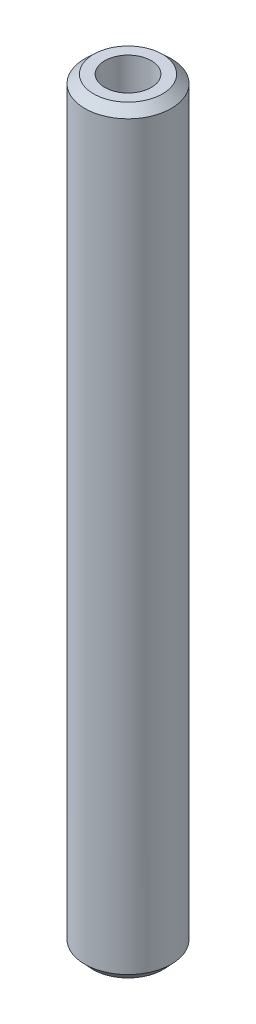
ISO-10303-21;
HEADER;
FILE_DESCRIPTION(('STEP AP214'),'2;1');
FILE_NAME('part.step','',(''),(''),'','','');
FILE_SCHEMA(('AUTOMOTIVE_DESIGN { 1 0 10303 214 1 1 1 1 }'));
ENDSEC;
DATA;
#1=APPLICATION_CONTEXT('core data for automotive mechanical design processes');
#2=APPLICATION_PROTOCOL_DEFINITION('international standard','automotive_design',2000,#1);
#3=PRODUCT_CONTEXT('',#1,'mechanical');
#4=PRODUCT('Part','Part','',(#3));
#5=PRODUCT_RELATED_PRODUCT_CATEGORY('part','',(#4));
#6=PRODUCT_DEFINITION_FORMATION('','',#4);
#7=PRODUCT_DEFINITION_CONTEXT('part definition',#1,'design');
#8=PRODUCT_DEFINITION('design','',#6,#7);
#9=PRODUCT_DEFINITION_SHAPE('','',#8);
#10=(LENGTH_UNIT() NAMED_UNIT(*) SI_UNIT(.MILLI.,.METRE.));
#11=(NAMED_UNIT(*) PLANE_ANGLE_UNIT() SI_UNIT($,.RADIAN.));
#12=(NAMED_UNIT(*) SI_UNIT($,.STERADIAN.) SOLID_ANGLE_UNIT());
#13=UNCERTAINTY_MEASURE_WITH_UNIT(LENGTH_MEASURE(1.E-05),#10,'distance_accuracy_value','');
#14=(GEOMETRIC_REPRESENTATION_CONTEXT(3) GLOBAL_UNCERTAINTY_ASSIGNED_CONTEXT((#13)) GLOBAL_UNIT_ASSIGNED_CONTEXT((#10,
#11,#12)) REPRESENTATION_CONTEXT('',''));
#15=CARTESIAN_POINT('',(0.,0.,0.));
#16=DIRECTION('',(0.,0.,1.));
#17=DIRECTION('',(1.,0.,0.));
#18=AXIS2_PLACEMENT_3D('',#15,#16,#17);
#19=CARTESIAN_POINT('',(0.,351.146910128849,0.));
#20=DIRECTION('',(0.,-1.,0.));
#21=DIRECTION('',(0.,0.,-1.));
#22=AXIS2_PLACEMENT_3D('',#19,#20,#21);
#23=CYLINDRICAL_SURFACE('',#22,20.);
#24=CARTESIAN_POINT('',(0.,347.326021928846,0.));
#25=DIRECTION('',(0.,1.,0.));
#26=DIRECTION('',(0.,0.,1.));
#27=AXIS2_PLACEMENT_3D('',#24,#25,#26);
#28=CIRCLE('',#27,20.);
#29=CARTESIAN_POINT('',(0.,347.326021928846,-20.));
#30=VERTEX_POINT('',#29);
#31=EDGE_CURVE('E50',#30,#30,#28,.F.);
#32=ORIENTED_EDGE('',*,*,#31,.T.);
#33=EDGE_LOOP('',(#32));
#34=FACE_BOUND('',#33,.T.);
#35=CARTESIAN_POINT('',(0.,4.06765184412189,0.));
#36=DIRECTION('',(0.,1.,0.));
#37=DIRECTION('',(0.,0.,1.));
#38=AXIS2_PLACEMENT_3D('',#35,#36,#37);
#39=CIRCLE('',#38,20.);
#40=CARTESIAN_POINT('',(0.,4.06765184412189,20.));
#41=VERTEX_POINT('',#40);
#42=EDGE_CURVE('E51',#41,#41,#39,.T.);
#43=ORIENTED_EDGE('',*,*,#42,.T.);
#44=EDGE_LOOP('',(#43));
#45=FACE_BOUND('',#44,.T.);
#46=ADVANCED_FACE('F39',(#34,#45),#23,.T.);
#47=CARTESIAN_POINT('',(0.,351.146910128849,0.));
#48=DIRECTION('',(0.,1.,0.));
#49=DIRECTION('',(0.,0.,1.));
#50=AXIS2_PLACEMENT_3D('',#47,#48,#49);
#51=PLANE('',#50);
#52=CARTESIAN_POINT('',(0.,351.146910128849,0.));
#53=DIRECTION('',(0.,1.,0.));
#54=DIRECTION('',(0.,0.,1.));
#55=AXIS2_PLACEMENT_3D('',#52,#53,#54);
#56=CIRCLE('',#55,15.932348155878);
#57=CARTESIAN_POINT('',(0.,351.146910128849,-15.932348155878));
#58=VERTEX_POINT('',#57);
#59=EDGE_CURVE('E54',#58,#58,#56,.T.);
#60=ORIENTED_EDGE('',*,*,#59,.T.);
#61=EDGE_LOOP('',(#60));
#62=FACE_BOUND('',#61,.T.);
#63=CARTESIAN_POINT('',(0.,351.146910128849,0.));
#64=DIRECTION('',(0.,1.,0.));
#65=DIRECTION('',(0.,0.,1.));
#66=AXIS2_PLACEMENT_3D('',#63,#64,#65);
#67=CIRCLE('',#66,10.7670784835726);
#68=CARTESIAN_POINT('',(0.,351.146910128849,10.7670784835726));
#69=VERTEX_POINT('',#68);
#70=EDGE_CURVE('E58',#69,#69,#67,.T.);
#71=ORIENTED_EDGE('',*,*,#70,.F.);
#72=EDGE_LOOP('',(#71));
#73=FACE_BOUND('',#72,.T.);
#74=ADVANCED_FACE('F69',(#62,#73),#51,.T.);
#75=CARTESIAN_POINT('',(0.,0.,0.));
#76=DIRECTION('',(0.,1.,0.));
#77=DIRECTION('',(0.,0.,1.));
#78=AXIS2_PLACEMENT_3D('',#75,#76,#77);
#79=PLANE('',#78);
#80=CARTESIAN_POINT('',(0.,0.,0.));
#81=DIRECTION('',(0.,1.,0.));
#82=DIRECTION('',(0.,0.,1.));
#83=AXIS2_PLACEMENT_3D('',#80,#81,#82);
#84=CIRCLE('',#83,16.1791117999965);
#85=CARTESIAN_POINT('',(0.,0.,16.1791117999965));
#86=VERTEX_POINT('',#85);
#87=EDGE_CURVE('E10',#86,#86,#84,.F.);
#88=ORIENTED_EDGE('',*,*,#87,.T.);
#89=EDGE_LOOP('',(#88));
#90=FACE_BOUND('',#89,.T.);
#91=CARTESIAN_POINT('',(0.,0.,0.));
#92=DIRECTION('',(0.,1.,0.));
#93=DIRECTION('',(0.,0.,1.));
#94=AXIS2_PLACEMENT_3D('',#91,#92,#93);
#95=CIRCLE('',#94,10.7670784835726);
#96=CARTESIAN_POINT('',(0.,0.,10.7670784835726));
#97=VERTEX_POINT('',#96);
#98=EDGE_CURVE('E63',#97,#97,#95,.T.);
#99=ORIENTED_EDGE('',*,*,#98,.T.);
#100=EDGE_LOOP('',(#99));
#101=FACE_BOUND('',#100,.T.);
#102=ADVANCED_FACE('F75',(#90,#101),#79,.F.);
#103=CARTESIAN_POINT('',(0.,351.146910128849,0.));
#104=DIRECTION('',(0.,-1.,0.));
#105=DIRECTION('',(0.,0.,-1.));
#106=AXIS2_PLACEMENT_3D('',#103,#104,#105);
#107=CYLINDRICAL_SURFACE('',#106,10.7670784835726);
#108=ORIENTED_EDGE('',*,*,#70,.T.);
#109=EDGE_LOOP('',(#108));
#110=FACE_BOUND('',#109,.T.);
#111=ORIENTED_EDGE('',*,*,#98,.F.);
#112=EDGE_LOOP('',(#111));
#113=FACE_BOUND('',#112,.T.);
#114=ADVANCED_FACE('F70',(#110,#113),#107,.F.);
#115=CARTESIAN_POINT('',(0.,351.146910128849,0.));
#116=DIRECTION('',(0.,-1.,0.));
#117=DIRECTION('',(0.,0.,-1.));
#118=AXIS2_PLACEMENT_3D('',#115,#116,#117);
#119=CONICAL_SURFACE('',#118,15.932348155878,0.816669248079316);
#120=CARTESIAN_POINT('',(0.,347.326021928846,-20.));
#121=CARTESIAN_POINT('',(0.,347.365822847596,-19.9576286266238));
#122=CARTESIAN_POINT('',(0.,347.405623766346,-19.9152572532475));
#123=CARTESIAN_POINT('',(0.,347.485225603846,-19.8305145064949));
#124=CARTESIAN_POINT('',(0.,347.525026522596,-19.7881431331187));
#125=CARTESIAN_POINT('',(0.,347.604628360096,-19.7034003863661));
#126=CARTESIAN_POINT('',(0.,347.644429278846,-19.6610290129899));
#127=CARTESIAN_POINT('',(0.,347.724031116346,-19.5762862662373));
#128=CARTESIAN_POINT('',(0.,347.763832035096,-19.5339148928611));
#129=CARTESIAN_POINT('',(0.,347.843433872596,-19.4491721461085));
#130=CARTESIAN_POINT('',(0.,347.883234791346,-19.4068007727322));
#131=CARTESIAN_POINT('',(0.,347.962836628846,-19.3220580259797));
#132=CARTESIAN_POINT('',(0.,348.002637547596,-19.2796866526034));
#133=CARTESIAN_POINT('',(0.,348.082239385096,-19.1949439058509));
#134=CARTESIAN_POINT('',(0.,348.122040303846,-19.1525725324746));
#135=CARTESIAN_POINT('',(0.,348.201642141346,-19.0678297857221));
#136=CARTESIAN_POINT('',(0.,348.241443060096,-19.0254584123458));
#137=CARTESIAN_POINT('',(0.,348.321044897596,-18.9407156655933));
#138=CARTESIAN_POINT('',(0.,348.360845816347,-18.898344292217));
#139=CARTESIAN_POINT('',(0.,348.440447653847,-18.8136015454645));
#140=CARTESIAN_POINT('',(0.,348.480248572597,-18.7712301720882));
#141=CARTESIAN_POINT('',(0.,348.559850410097,-18.6864874253356));
#142=CARTESIAN_POINT('',(0.,348.599651328847,-18.6441160519594));
#143=CARTESIAN_POINT('',(0.,348.679253166347,-18.5593733052068));
#144=CARTESIAN_POINT('',(0.,348.719054085097,-18.5170019318306));
#145=CARTESIAN_POINT('',(0.,348.798655922597,-18.432259185078));
#146=CARTESIAN_POINT('',(0.,348.838456841347,-18.3898878117017));
#147=CARTESIAN_POINT('',(0.,348.918058678847,-18.3051450649492));
#148=CARTESIAN_POINT('',(0.,348.957859597597,-18.2627736915729));
#149=CARTESIAN_POINT('',(0.,349.037461435097,-18.1780309448204));
#150=CARTESIAN_POINT('',(0.,349.077262353847,-18.1356595714441));
#151=CARTESIAN_POINT('',(0.,349.156864191347,-18.0509168246916));
#152=CARTESIAN_POINT('',(0.,349.196665110097,-18.0085454513153));
#153=CARTESIAN_POINT('',(0.,349.276266947597,-17.9238027045628));
#154=CARTESIAN_POINT('',(0.,349.316067866347,-17.8814313311865));
#155=CARTESIAN_POINT('',(0.,349.395669703847,-17.796688584434));
#156=CARTESIAN_POINT('',(0.,349.435470622598,-17.7543172110577));
#157=CARTESIAN_POINT('',(0.,349.515072460098,-17.6695744643051));
#158=CARTESIAN_POINT('',(0.,349.554873378848,-17.6272030909289));
#159=CARTESIAN_POINT('',(0.,349.634475216348,-17.5424603441763));
#160=CARTESIAN_POINT('',(0.,349.674276135098,-17.5000889708001));
#161=CARTESIAN_POINT('',(0.,349.753877972598,-17.4153462240475));
#162=CARTESIAN_POINT('',(0.,349.793678891348,-17.3729748506712));
#163=CARTESIAN_POINT('',(0.,349.873280728848,-17.2882321039187));
#164=CARTESIAN_POINT('',(0.,349.913081647598,-17.2458607305424));
#165=CARTESIAN_POINT('',(0.,349.992683485098,-17.1611179837899));
#166=CARTESIAN_POINT('',(0.,350.032484403848,-17.1187466104136));
#167=CARTESIAN_POINT('',(0.,350.112086241348,-17.0340038636611));
#168=CARTESIAN_POINT('',(0.,350.151887160098,-16.9916324902848));
#169=CARTESIAN_POINT('',(0.,350.231488997598,-16.9068897435323));
#170=CARTESIAN_POINT('',(0.,350.271289916348,-16.864518370156));
#171=CARTESIAN_POINT('',(0.,350.350891753848,-16.7797756234035));
#172=CARTESIAN_POINT('',(0.,350.390692672598,-16.7374042500272));
#173=CARTESIAN_POINT('',(0.,350.470294510098,-16.6526615032747));
#174=CARTESIAN_POINT('',(0.,350.510095428849,-16.6102901298984));
#175=CARTESIAN_POINT('',(0.,350.589697266349,-16.5255473831458));
#176=CARTESIAN_POINT('',(0.,350.629498185099,-16.4831760097696));
#177=CARTESIAN_POINT('',(0.,350.709100022599,-16.398433263017));
#178=CARTESIAN_POINT('',(0.,350.748900941349,-16.3560618896408));
#179=CARTESIAN_POINT('',(0.,350.828502778849,-16.2713191428882));
#180=CARTESIAN_POINT('',(0.,350.868303697599,-16.2289477695119));
#181=CARTESIAN_POINT('',(0.,350.947905535099,-16.1442050227594));
#182=CARTESIAN_POINT('',(0.,350.987706453849,-16.1018336493831));
#183=CARTESIAN_POINT('',(0.,351.067308291349,-16.0170909026306));
#184=CARTESIAN_POINT('',(0.,351.107109210099,-15.9747195292543));
#185=CARTESIAN_POINT('',(0.,351.146910128849,-15.932348155878));
#186=B_SPLINE_CURVE_WITH_KNOTS('',3,(#120,#121,#122,#123,#124,#125,#126,#127,#128,#129,#130,
#131,#132,#133,#134,#135,#136,#137,#138,#139,#140,#141,#142,#143,#144,#145,#146,#147,#148,#149,
#150,#151,#152,#153,#154,#155,#156,#157,#158,#159,#160,#161,#162,#163,#164,#165,#166,#167,#168,
#169,#170,#171,#172,#173,#174,#175,#176,#177,#178,#179,#180,#181,#182,#183,#184,#185),
.UNSPECIFIED.,.F.,.F.,(4,2,2,2,2,2,2,2,2,2,2,2,2,2,2,2,2,2,2,2,2,2,2,2,2,2,2,2,2,2,2,2,4),(0.,
0.174399018736475,0.348798037472948,0.523197056209421,0.697596074945897,0.87199509368237,
1.04639411241884,1.22079313115532,1.39519214989179,1.56959116862827,1.74399018736474,
1.91838920610121,2.09278822483769,2.26718724357416,2.44158626231063,2.61598528104711,
2.79038429978358,2.96478331852005,3.13918233725653,3.313581355993,3.48798037472948,
3.66237939346595,3.83677841220242,4.0111774309389,4.18557644967537,4.35997546841184,
4.53437448714832,4.70877350588479,4.88317252462127,5.05757154335774,5.23197056209422,
5.40636958083069,5.5807685995672),.UNSPECIFIED.);
#187=EDGE_CURVE('BSEAM81',#30,#58,#186,.T.);
#188=ORIENTED_EDGE('',*,*,#31,.F.);
#189=ORIENTED_EDGE('',*,*,#59,.F.);
#190=ORIENTED_EDGE('',*,*,#187,.T.);
#191=ORIENTED_EDGE('',*,*,#187,.F.);
#192=EDGE_LOOP('',(#188,#190,#189,#191));
#193=FACE_BOUND('',#192,.T.);
#194=ADVANCED_FACE('F81',(#193),#119,.T.);
#195=CARTESIAN_POINT('',(0.,4.06765184412189,0.));
#196=DIRECTION('',(0.,1.,0.));
#197=DIRECTION('',(0.,0.,1.));
#198=AXIS2_PLACEMENT_3D('',#195,#196,#197);
#199=CONICAL_SURFACE('',#198,20.,0.754127078715583);
#200=ORIENTED_EDGE('',*,*,#87,.F.);
#201=EDGE_LOOP('',(#200));
#202=FACE_BOUND('',#201,.T.);
#203=ORIENTED_EDGE('',*,*,#42,.F.);
#204=EDGE_LOOP('',(#203));
#205=FACE_BOUND('',#204,.T.);
#206=ADVANCED_FACE('F45',(#202,#205),#199,.T.);
#207=CLOSED_SHELL('',(#46,#74,#102,#114,#194,#206));
#208=MANIFOLD_SOLID_BREP('B2',#207);
#209=ADVANCED_BREP_SHAPE_REPRESENTATION('',(#18,#208),#14);
#210=SHAPE_DEFINITION_REPRESENTATION(#9,#209);
ENDSEC;
END-ISO-10303-21;
